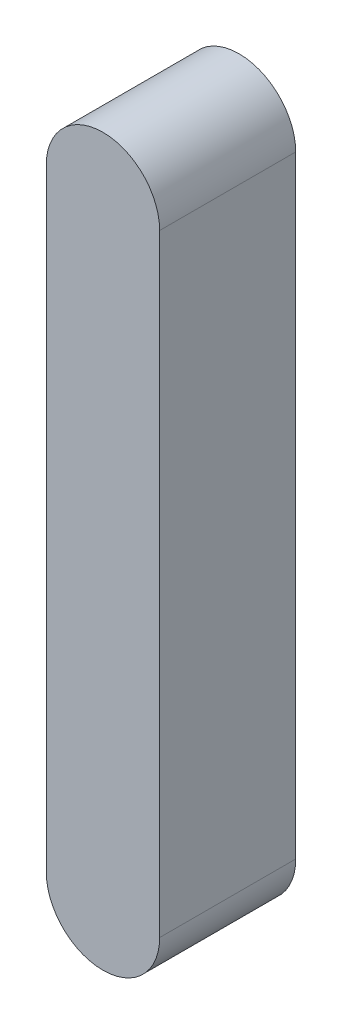
ISO-10303-21;
HEADER;
FILE_DESCRIPTION(('STEP AP214'),'2;1');
FILE_NAME('part.step','',(''),(''),'','','');
FILE_SCHEMA(('AUTOMOTIVE_DESIGN { 1 0 10303 214 1 1 1 1 }'));
ENDSEC;
DATA;
#1=APPLICATION_CONTEXT('core data for automotive mechanical design processes');
#2=APPLICATION_PROTOCOL_DEFINITION('international standard','automotive_design',2000,#1);
#3=PRODUCT_CONTEXT('',#1,'mechanical');
#4=PRODUCT('Part','Part','',(#3));
#5=PRODUCT_RELATED_PRODUCT_CATEGORY('part','',(#4));
#6=PRODUCT_DEFINITION_FORMATION('','',#4);
#7=PRODUCT_DEFINITION_CONTEXT('part definition',#1,'design');
#8=PRODUCT_DEFINITION('design','',#6,#7);
#9=PRODUCT_DEFINITION_SHAPE('','',#8);
#10=(LENGTH_UNIT() NAMED_UNIT(*) SI_UNIT(.MILLI.,.METRE.));
#11=(NAMED_UNIT(*) PLANE_ANGLE_UNIT() SI_UNIT($,.RADIAN.));
#12=(NAMED_UNIT(*) SI_UNIT($,.STERADIAN.) SOLID_ANGLE_UNIT());
#13=UNCERTAINTY_MEASURE_WITH_UNIT(LENGTH_MEASURE(1.E-05),#10,'distance_accuracy_value','');
#14=(GEOMETRIC_REPRESENTATION_CONTEXT(3) GLOBAL_UNCERTAINTY_ASSIGNED_CONTEXT((#13)) GLOBAL_UNIT_ASSIGNED_CONTEXT((#10,
#11,#12)) REPRESENTATION_CONTEXT('',''));
#15=CARTESIAN_POINT('',(0.,0.,0.));
#16=DIRECTION('',(0.,0.,1.));
#17=DIRECTION('',(1.,0.,0.));
#18=AXIS2_PLACEMENT_3D('',#15,#16,#17);
#19=CARTESIAN_POINT('',(0.,0.,15.));
#20=DIRECTION('',(0.,0.,-1.));
#21=DIRECTION('',(-1.,0.,0.));
#22=AXIS2_PLACEMENT_3D('',#19,#20,#21);
#23=CYLINDRICAL_SURFACE('',#22,12.5);
#24=CARTESIAN_POINT('',(0.,0.,-15.));
#25=DIRECTION('',(0.,0.,1.));
#26=DIRECTION('',(1.,0.,0.));
#27=AXIS2_PLACEMENT_3D('',#24,#25,#26);
#28=CIRCLE('',#27,12.5);
#29=CARTESIAN_POINT('',(-12.5,0.,-15.));
#30=VERTEX_POINT('',#29);
#31=CARTESIAN_POINT('',(12.5,0.,-15.));
#32=VERTEX_POINT('',#31);
#33=EDGE_CURVE('E97',#30,#32,#28,.T.);
#34=ORIENTED_EDGE('',*,*,#33,.T.);
#35=DIRECTION('',(0.,0.,-1.));
#36=VECTOR('',#35,1.);
#37=CARTESIAN_POINT('',(12.5,0.,15.));
#38=LINE('',#37,#36);
#39=CARTESIAN_POINT('',(12.5,0.,15.));
#40=VERTEX_POINT('',#39);
#41=EDGE_CURVE('E11',#40,#32,#38,.T.);
#42=ORIENTED_EDGE('',*,*,#41,.F.);
#43=CARTESIAN_POINT('',(0.,0.,15.));
#44=DIRECTION('',(0.,0.,1.));
#45=DIRECTION('',(1.,0.,0.));
#46=AXIS2_PLACEMENT_3D('',#43,#44,#45);
#47=CIRCLE('',#46,12.5);
#48=CARTESIAN_POINT('',(-12.5,0.,15.));
#49=VERTEX_POINT('',#48);
#50=EDGE_CURVE('E85',#49,#40,#47,.T.);
#51=ORIENTED_EDGE('',*,*,#50,.F.);
#52=DIRECTION('',(0.,0.,-1.));
#53=VECTOR('',#52,1.);
#54=CARTESIAN_POINT('',(-12.5,0.,15.));
#55=LINE('',#54,#53);
#56=EDGE_CURVE('E93',#49,#30,#55,.T.);
#57=ORIENTED_EDGE('',*,*,#56,.T.);
#58=EDGE_LOOP('',(#34,#42,#51,#57));
#59=FACE_BOUND('',#58,.T.);
#60=ADVANCED_FACE('F34',(#59),#23,.T.);
#61=CARTESIAN_POINT('',(12.5,0.,15.));
#62=DIRECTION('',(-1.,0.,0.));
#63=DIRECTION('',(0.,0.,1.));
#64=AXIS2_PLACEMENT_3D('',#61,#62,#63);
#65=PLANE('',#64);
#66=DIRECTION('',(0.,1.,0.));
#67=VECTOR('',#66,1.);
#68=CARTESIAN_POINT('',(12.5,0.,-15.));
#69=LINE('',#68,#67);
#70=CARTESIAN_POINT('',(12.5,135.,-15.));
#71=VERTEX_POINT('',#70);
#72=EDGE_CURVE('E89',#32,#71,#69,.T.);
#73=ORIENTED_EDGE('',*,*,#72,.T.);
#74=DIRECTION('',(0.,0.,-1.));
#75=VECTOR('',#74,1.);
#76=CARTESIAN_POINT('',(12.5,135.,15.));
#77=LINE('',#76,#75);
#78=CARTESIAN_POINT('',(12.5,135.,15.));
#79=VERTEX_POINT('',#78);
#80=EDGE_CURVE('E42',#79,#71,#77,.T.);
#81=ORIENTED_EDGE('',*,*,#80,.F.);
#82=DIRECTION('',(0.,1.,0.));
#83=VECTOR('',#82,1.);
#84=CARTESIAN_POINT('',(12.5,0.,15.));
#85=LINE('',#84,#83);
#86=EDGE_CURVE('E80',#40,#79,#85,.T.);
#87=ORIENTED_EDGE('',*,*,#86,.F.);
#88=ORIENTED_EDGE('',*,*,#41,.T.);
#89=EDGE_LOOP('',(#73,#81,#87,#88));
#90=FACE_BOUND('',#89,.T.);
#91=ADVANCED_FACE('F88',(#90),#65,.F.);
#92=CARTESIAN_POINT('',(0.,135.,15.));
#93=DIRECTION('',(0.,0.,-1.));
#94=DIRECTION('',(-1.,0.,0.));
#95=AXIS2_PLACEMENT_3D('',#92,#93,#94);
#96=CYLINDRICAL_SURFACE('',#95,12.5);
#97=CARTESIAN_POINT('',(0.,135.,-15.));
#98=DIRECTION('',(0.,0.,1.));
#99=DIRECTION('',(1.,0.,0.));
#100=AXIS2_PLACEMENT_3D('',#97,#98,#99);
#101=CIRCLE('',#100,12.5);
#102=CARTESIAN_POINT('',(-12.5,135.,-15.));
#103=VERTEX_POINT('',#102);
#104=EDGE_CURVE('E67',#71,#103,#101,.T.);
#105=ORIENTED_EDGE('',*,*,#104,.T.);
#106=DIRECTION('',(0.,0.,-1.));
#107=VECTOR('',#106,1.);
#108=CARTESIAN_POINT('',(-12.5,135.,15.));
#109=LINE('',#108,#107);
#110=CARTESIAN_POINT('',(-12.5,135.,15.));
#111=VERTEX_POINT('',#110);
#112=EDGE_CURVE('E90',#111,#103,#109,.T.);
#113=ORIENTED_EDGE('',*,*,#112,.F.);
#114=CARTESIAN_POINT('',(0.,135.,15.));
#115=DIRECTION('',(0.,0.,1.));
#116=DIRECTION('',(1.,0.,0.));
#117=AXIS2_PLACEMENT_3D('',#114,#115,#116);
#118=CIRCLE('',#117,12.5);
#119=EDGE_CURVE('E83',#79,#111,#118,.T.);
#120=ORIENTED_EDGE('',*,*,#119,.F.);
#121=ORIENTED_EDGE('',*,*,#80,.T.);
#122=EDGE_LOOP('',(#105,#113,#120,#121));
#123=FACE_BOUND('',#122,.T.);
#124=ADVANCED_FACE('F91',(#123),#96,.T.);
#125=CARTESIAN_POINT('',(-12.5,0.,15.));
#126=DIRECTION('',(1.,0.,0.));
#127=DIRECTION('',(0.,0.,-1.));
#128=AXIS2_PLACEMENT_3D('',#125,#126,#127);
#129=PLANE('',#128);
#130=DIRECTION('',(0.,-1.,0.));
#131=VECTOR('',#130,1.);
#132=CARTESIAN_POINT('',(-12.5,0.,-15.));
#133=LINE('',#132,#131);
#134=EDGE_CURVE('E73',#103,#30,#133,.T.);
#135=ORIENTED_EDGE('',*,*,#134,.T.);
#136=ORIENTED_EDGE('',*,*,#56,.F.);
#137=DIRECTION('',(0.,-1.,0.));
#138=VECTOR('',#137,1.);
#139=CARTESIAN_POINT('',(-12.5,0.,15.));
#140=LINE('',#139,#138);
#141=EDGE_CURVE('E50',#111,#49,#140,.T.);
#142=ORIENTED_EDGE('',*,*,#141,.F.);
#143=ORIENTED_EDGE('',*,*,#112,.T.);
#144=EDGE_LOOP('',(#135,#136,#142,#143));
#145=FACE_BOUND('',#144,.T.);
#146=ADVANCED_FACE('F104',(#145),#129,.F.);
#147=CARTESIAN_POINT('',(0.,0.,15.));
#148=DIRECTION('',(0.,0.,1.));
#149=DIRECTION('',(1.,0.,0.));
#150=AXIS2_PLACEMENT_3D('',#147,#148,#149);
#151=PLANE('',#150);
#152=ORIENTED_EDGE('',*,*,#50,.T.);
#153=ORIENTED_EDGE('',*,*,#86,.T.);
#154=ORIENTED_EDGE('',*,*,#119,.T.);
#155=ORIENTED_EDGE('',*,*,#141,.T.);
#156=EDGE_LOOP('',(#152,#153,#154,#155));
#157=FACE_BOUND('',#156,.T.);
#158=ADVANCED_FACE('F81',(#157),#151,.T.);
#159=CARTESIAN_POINT('',(0.,0.,-15.));
#160=DIRECTION('',(0.,0.,1.));
#161=DIRECTION('',(1.,0.,0.));
#162=AXIS2_PLACEMENT_3D('',#159,#160,#161);
#163=PLANE('',#162);
#164=ORIENTED_EDGE('',*,*,#33,.F.);
#165=ORIENTED_EDGE('',*,*,#134,.F.);
#166=ORIENTED_EDGE('',*,*,#104,.F.);
#167=ORIENTED_EDGE('',*,*,#72,.F.);
#168=EDGE_LOOP('',(#164,#165,#166,#167));
#169=FACE_BOUND('',#168,.T.);
#170=ADVANCED_FACE('F107',(#169),#163,.F.);
#171=CLOSED_SHELL('',(#60,#91,#124,#146,#158,#170));
#172=MANIFOLD_SOLID_BREP('B2',#171);
#173=ADVANCED_BREP_SHAPE_REPRESENTATION('',(#18,#172),#14);
#174=SHAPE_DEFINITION_REPRESENTATION(#9,#173);
ENDSEC;
END-ISO-10303-21;
